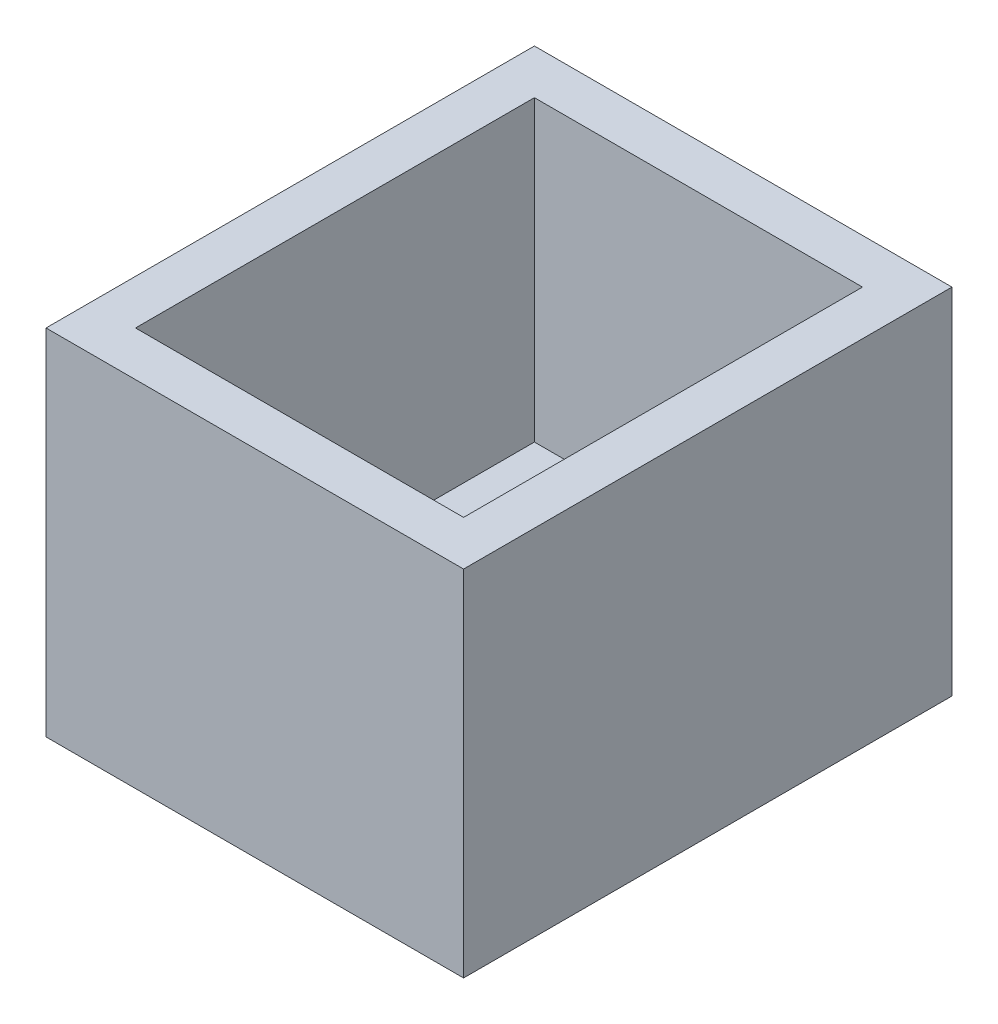
ISO-10303-21;
HEADER;
FILE_DESCRIPTION(('STEP AP214'),'2;1');
FILE_NAME('part.step','',(''),(''),'','','');
FILE_SCHEMA(('AUTOMOTIVE_DESIGN { 1 0 10303 214 1 1 1 1 }'));
ENDSEC;
DATA;
#1=APPLICATION_CONTEXT('core data for automotive mechanical design processes');
#2=APPLICATION_PROTOCOL_DEFINITION('international standard','automotive_design',2000,#1);
#3=PRODUCT_CONTEXT('',#1,'mechanical');
#4=PRODUCT('Part','Part','',(#3));
#5=PRODUCT_RELATED_PRODUCT_CATEGORY('part','',(#4));
#6=PRODUCT_DEFINITION_FORMATION('','',#4);
#7=PRODUCT_DEFINITION_CONTEXT('part definition',#1,'design');
#8=PRODUCT_DEFINITION('design','',#6,#7);
#9=PRODUCT_DEFINITION_SHAPE('','',#8);
#10=(LENGTH_UNIT() NAMED_UNIT(*) SI_UNIT(.MILLI.,.METRE.));
#11=(NAMED_UNIT(*) PLANE_ANGLE_UNIT() SI_UNIT($,.RADIAN.));
#12=(NAMED_UNIT(*) SI_UNIT($,.STERADIAN.) SOLID_ANGLE_UNIT());
#13=UNCERTAINTY_MEASURE_WITH_UNIT(LENGTH_MEASURE(1.E-05),#10,'distance_accuracy_value','');
#14=(GEOMETRIC_REPRESENTATION_CONTEXT(3) GLOBAL_UNCERTAINTY_ASSIGNED_CONTEXT((#13)) GLOBAL_UNIT_ASSIGNED_CONTEXT((#10,
#11,#12)) REPRESENTATION_CONTEXT('',''));
#15=CARTESIAN_POINT('',(0.,0.,0.));
#16=DIRECTION('',(0.,0.,1.));
#17=DIRECTION('',(1.,0.,0.));
#18=AXIS2_PLACEMENT_3D('',#15,#16,#17);
#19=CARTESIAN_POINT('',(0.,3.75,0.));
#20=DIRECTION('',(0.,1.,0.));
#21=DIRECTION('',(0.,0.,1.));
#22=AXIS2_PLACEMENT_3D('',#19,#20,#21);
#23=PLANE('',#22);
#24=DIRECTION('',(1.,0.,0.));
#25=VECTOR('',#24,1.);
#26=CARTESIAN_POINT('',(-55.4845587153636,3.75,25.2797790018917));
#27=LINE('',#26,#25);
#28=CARTESIAN_POINT('',(-50.9845587153636,3.75,25.2797790018917));
#29=VERTEX_POINT('',#28);
#30=CARTESIAN_POINT('',(-43.9845587153636,3.75,25.2797790018917));
#31=VERTEX_POINT('',#30);
#32=EDGE_CURVE('E363',#29,#31,#27,.T.);
#33=ORIENTED_EDGE('',*,*,#32,.F.);
#34=DIRECTION('',(0.,0.,-1.));
#35=VECTOR('',#34,1.);
#36=CARTESIAN_POINT('',(-50.9845587153636,3.75,25.2797790018917));
#37=LINE('',#36,#35);
#38=CARTESIAN_POINT('',(-50.9845587153636,3.75,24.0297790018917));
#39=VERTEX_POINT('',#38);
#40=EDGE_CURVE('E305',#29,#39,#37,.T.);
#41=ORIENTED_EDGE('',*,*,#40,.T.);
#42=DIRECTION('',(-1.,0.,0.));
#43=VECTOR('',#42,1.);
#44=CARTESIAN_POINT('',(-50.9845587153636,3.75,24.0297790018917));
#45=LINE('',#44,#43);
#46=CARTESIAN_POINT('',(-54.2345587153636,3.75,24.0297790018917));
#47=VERTEX_POINT('',#46);
#48=EDGE_CURVE('E339',#39,#47,#45,.T.);
#49=ORIENTED_EDGE('',*,*,#48,.T.);
#50=DIRECTION('',(0.,0.,-1.));
#51=VECTOR('',#50,1.);
#52=CARTESIAN_POINT('',(-54.2345587153636,3.75,24.0297790018917));
#53=LINE('',#52,#51);
#54=CARTESIAN_POINT('',(-54.2345587153636,3.75,5.77977900189171));
#55=VERTEX_POINT('',#54);
#56=EDGE_CURVE('E342',#47,#55,#53,.T.);
#57=ORIENTED_EDGE('',*,*,#56,.T.);
#58=DIRECTION('',(1.,0.,0.));
#59=VECTOR('',#58,1.);
#60=CARTESIAN_POINT('',(-54.2345587153636,3.75,5.77977900189171));
#61=LINE('',#60,#59);
#62=CARTESIAN_POINT('',(-50.9845587153636,3.75,5.77977900189171));
#63=VERTEX_POINT('',#62);
#64=EDGE_CURVE('E345',#55,#63,#61,.T.);
#65=ORIENTED_EDGE('',*,*,#64,.T.);
#66=DIRECTION('',(0.,0.,-1.));
#67=VECTOR('',#66,1.);
#68=CARTESIAN_POINT('',(-50.9845587153636,3.75,5.77977900189171));
#69=LINE('',#68,#67);
#70=CARTESIAN_POINT('',(-50.9845587153636,3.75,4.52977900189171));
#71=VERTEX_POINT('',#70);
#72=EDGE_CURVE('E318',#63,#71,#69,.T.);
#73=ORIENTED_EDGE('',*,*,#72,.T.);
#74=DIRECTION('',(-1.,0.,0.));
#75=VECTOR('',#74,1.);
#76=CARTESIAN_POINT('',(-55.4845587153636,3.75,4.52977900189171));
#77=LINE('',#76,#75);
#78=CARTESIAN_POINT('',(-43.9845587153636,3.75,4.52977900189171));
#79=VERTEX_POINT('',#78);
#80=EDGE_CURVE('E365',#79,#71,#77,.T.);
#81=ORIENTED_EDGE('',*,*,#80,.F.);
#82=DIRECTION('',(0.,0.,1.));
#83=VECTOR('',#82,1.);
#84=CARTESIAN_POINT('',(-43.9845587153636,3.75,5.77977900189171));
#85=LINE('',#84,#83);
#86=CARTESIAN_POINT('',(-43.9845587153636,3.75,5.77977900189171));
#87=VERTEX_POINT('',#86);
#88=EDGE_CURVE('E265',#79,#87,#85,.T.);
#89=ORIENTED_EDGE('',*,*,#88,.T.);
#90=DIRECTION('',(1.,0.,0.));
#91=VECTOR('',#90,1.);
#92=CARTESIAN_POINT('',(-43.9845587153636,3.75,5.77977900189171));
#93=LINE('',#92,#91);
#94=CARTESIAN_POINT('',(-40.7345587153636,3.75,5.77977900189171));
#95=VERTEX_POINT('',#94);
#96=EDGE_CURVE('E291',#87,#95,#93,.T.);
#97=ORIENTED_EDGE('',*,*,#96,.T.);
#98=DIRECTION('',(0.,0.,1.));
#99=VECTOR('',#98,1.);
#100=CARTESIAN_POINT('',(-40.7345587153636,3.75,5.77977900189171));
#101=LINE('',#100,#99);
#102=CARTESIAN_POINT('',(-40.7345587153636,3.75,24.0297790018917));
#103=VERTEX_POINT('',#102);
#104=EDGE_CURVE('E294',#95,#103,#101,.T.);
#105=ORIENTED_EDGE('',*,*,#104,.T.);
#106=DIRECTION('',(-1.,0.,0.));
#107=VECTOR('',#106,1.);
#108=CARTESIAN_POINT('',(-40.7345587153636,3.75,24.0297790018917));
#109=LINE('',#108,#107);
#110=CARTESIAN_POINT('',(-43.9845587153636,3.75,24.0297790018917));
#111=VERTEX_POINT('',#110);
#112=EDGE_CURVE('E297',#103,#111,#109,.T.);
#113=ORIENTED_EDGE('',*,*,#112,.T.);
#114=DIRECTION('',(0.,0.,1.));
#115=VECTOR('',#114,1.);
#116=CARTESIAN_POINT('',(-43.9845587153636,3.75,25.2797790018917));
#117=LINE('',#116,#115);
#118=EDGE_CURVE('E270',#111,#31,#117,.T.);
#119=ORIENTED_EDGE('',*,*,#118,.T.);
#120=EDGE_LOOP('',(#33,#41,#49,#57,#65,#73,#81,#89,#97,#105,#113,#119));
#121=FACE_BOUND('',#120,.T.);
#122=DIRECTION('',(1.,0.,0.));
#123=VECTOR('',#122,1.);
#124=CARTESIAN_POINT('',(-36.4845587153636,3.75,28.2797790018917));
#125=LINE('',#124,#123);
#126=CARTESIAN_POINT('',(-58.4845587153636,3.75,28.2797790018917));
#127=VERTEX_POINT('',#126);
#128=CARTESIAN_POINT('',(-36.4845587153636,3.75,28.2797790018917));
#129=VERTEX_POINT('',#128);
#130=EDGE_CURVE('E226',#127,#129,#125,.T.);
#131=ORIENTED_EDGE('',*,*,#130,.T.);
#132=DIRECTION('',(0.,0.,-1.));
#133=VECTOR('',#132,1.);
#134=CARTESIAN_POINT('',(-36.4845587153636,3.75,1.52977900189171));
#135=LINE('',#134,#133);
#136=CARTESIAN_POINT('',(-36.4845587153636,3.75,1.52977900189171));
#137=VERTEX_POINT('',#136);
#138=EDGE_CURVE('E48',#129,#137,#135,.T.);
#139=ORIENTED_EDGE('',*,*,#138,.T.);
#140=DIRECTION('',(-1.,0.,0.));
#141=VECTOR('',#140,1.);
#142=CARTESIAN_POINT('',(-36.4845587153636,3.75,1.52977900189171));
#143=LINE('',#142,#141);
#144=CARTESIAN_POINT('',(-58.4845587153636,3.75,1.52977900189171));
#145=VERTEX_POINT('',#144);
#146=EDGE_CURVE('E223',#137,#145,#143,.T.);
#147=ORIENTED_EDGE('',*,*,#146,.T.);
#148=DIRECTION('',(0.,0.,1.));
#149=VECTOR('',#148,1.);
#150=CARTESIAN_POINT('',(-58.4845587153636,3.75,1.52977900189171));
#151=LINE('',#150,#149);
#152=EDGE_CURVE('E210',#145,#127,#151,.T.);
#153=ORIENTED_EDGE('',*,*,#152,.T.);
#154=EDGE_LOOP('',(#131,#139,#147,#153));
#155=FACE_BOUND('',#154,.T.);
#156=ADVANCED_FACE('F33',(#121,#155),#23,.T.);
#157=CARTESIAN_POINT('',(-55.4845587153636,3.75,25.2797790018917));
#158=DIRECTION('',(1.,0.,0.));
#159=DIRECTION('',(0.,0.,-1.));
#160=AXIS2_PLACEMENT_3D('',#157,#158,#159);
#161=PLANE('',#160);
#162=DIRECTION('',(0.,-1.,0.));
#163=VECTOR('',#162,1.);
#164=CARTESIAN_POINT('',(-55.4845587153636,3.75,4.52977900189171));
#165=LINE('',#164,#163);
#166=CARTESIAN_POINT('',(-55.4845587153636,1.875,4.52977900189171));
#167=VERTEX_POINT('',#166);
#168=CARTESIAN_POINT('',(-55.4845587153636,0.,4.52977900189171));
#169=VERTEX_POINT('',#168);
#170=EDGE_CURVE('E368',#167,#169,#165,.T.);
#171=ORIENTED_EDGE('',*,*,#170,.F.);
#172=DIRECTION('',(0.,0.,1.));
#173=VECTOR('',#172,1.);
#174=CARTESIAN_POINT('',(-55.4845587153636,1.875,25.2797790018917));
#175=LINE('',#174,#173);
#176=CARTESIAN_POINT('',(-55.4845587153636,1.875,25.2797790018917));
#177=VERTEX_POINT('',#176);
#178=EDGE_CURVE('E332',#167,#177,#175,.T.);
#179=ORIENTED_EDGE('',*,*,#178,.T.);
#180=DIRECTION('',(0.,-1.,0.));
#181=VECTOR('',#180,1.);
#182=CARTESIAN_POINT('',(-55.4845587153636,3.75,25.2797790018917));
#183=LINE('',#182,#181);
#184=CARTESIAN_POINT('',(-55.4845587153636,0.,25.2797790018917));
#185=VERTEX_POINT('',#184);
#186=EDGE_CURVE('E11',#177,#185,#183,.T.);
#187=ORIENTED_EDGE('',*,*,#186,.T.);
#188=DIRECTION('',(0.,0.,1.));
#189=VECTOR('',#188,1.);
#190=CARTESIAN_POINT('',(-55.4845587153636,0.,25.2797790018917));
#191=LINE('',#190,#189);
#192=EDGE_CURVE('E352',#169,#185,#191,.T.);
#193=ORIENTED_EDGE('',*,*,#192,.F.);
#194=EDGE_LOOP('',(#171,#179,#187,#193));
#195=FACE_BOUND('',#194,.T.);
#196=ADVANCED_FACE('F395',(#195),#161,.T.);
#197=CARTESIAN_POINT('',(0.,0.,0.));
#198=DIRECTION('',(0.,1.,0.));
#199=DIRECTION('',(0.,0.,1.));
#200=AXIS2_PLACEMENT_3D('',#197,#198,#199);
#201=PLANE('',#200);
#202=DIRECTION('',(-1.,0.,0.));
#203=VECTOR('',#202,1.);
#204=CARTESIAN_POINT('',(-58.4845587153636,0.,-1.47022099810829));
#205=LINE('',#204,#203);
#206=CARTESIAN_POINT('',(-33.4845587153636,0.,-1.47022099810829));
#207=VERTEX_POINT('',#206);
#208=CARTESIAN_POINT('',(-61.4845587153636,0.,-1.47022099810829));
#209=VERTEX_POINT('',#208);
#210=EDGE_CURVE('E263',#207,#209,#205,.T.);
#211=ORIENTED_EDGE('',*,*,#210,.F.);
#212=DIRECTION('',(0.,0.,-1.));
#213=VECTOR('',#212,1.);
#214=CARTESIAN_POINT('',(-33.4845587153636,0.,-1.47022099810829));
#215=LINE('',#214,#213);
#216=CARTESIAN_POINT('',(-33.4845587153636,0.,31.2797790018917));
#217=VERTEX_POINT('',#216);
#218=EDGE_CURVE('E250',#217,#207,#215,.T.);
#219=ORIENTED_EDGE('',*,*,#218,.F.);
#220=DIRECTION('',(1.,0.,0.));
#221=VECTOR('',#220,1.);
#222=CARTESIAN_POINT('',(-36.4845587153636,0.,31.2797790018917));
#223=LINE('',#222,#221);
#224=CARTESIAN_POINT('',(-61.4845587153636,0.,31.2797790018917));
#225=VERTEX_POINT('',#224);
#226=EDGE_CURVE('E256',#225,#217,#223,.T.);
#227=ORIENTED_EDGE('',*,*,#226,.F.);
#228=DIRECTION('',(0.,0.,1.));
#229=VECTOR('',#228,1.);
#230=CARTESIAN_POINT('',(-61.4845587153636,0.,28.2797790018917));
#231=LINE('',#230,#229);
#232=EDGE_CURVE('E261',#209,#225,#231,.T.);
#233=ORIENTED_EDGE('',*,*,#232,.F.);
#234=EDGE_LOOP('',(#211,#219,#227,#233));
#235=FACE_BOUND('',#234,.T.);
#236=ORIENTED_EDGE('',*,*,#192,.T.);
#237=DIRECTION('',(1.,0.,0.));
#238=VECTOR('',#237,1.);
#239=CARTESIAN_POINT('',(-55.4845587153636,0.,25.2797790018917));
#240=LINE('',#239,#238);
#241=CARTESIAN_POINT('',(-39.4845587153636,0.,25.2797790018917));
#242=VERTEX_POINT('',#241);
#243=EDGE_CURVE('E371',#185,#242,#240,.T.);
#244=ORIENTED_EDGE('',*,*,#243,.T.);
#245=DIRECTION('',(0.,0.,-1.));
#246=VECTOR('',#245,1.);
#247=CARTESIAN_POINT('',(-39.4845587153636,0.,25.2797790018917));
#248=LINE('',#247,#246);
#249=CARTESIAN_POINT('',(-39.4845587153636,0.,4.52977900189171));
#250=VERTEX_POINT('',#249);
#251=EDGE_CURVE('E374',#242,#250,#248,.T.);
#252=ORIENTED_EDGE('',*,*,#251,.T.);
#253=DIRECTION('',(-1.,0.,0.));
#254=VECTOR('',#253,1.);
#255=CARTESIAN_POINT('',(-55.4845587153636,0.,4.52977900189171));
#256=LINE('',#255,#254);
#257=EDGE_CURVE('E366',#250,#169,#256,.T.);
#258=ORIENTED_EDGE('',*,*,#257,.T.);
#259=EDGE_LOOP('',(#236,#244,#252,#258));
#260=FACE_BOUND('',#259,.T.);
#261=ADVANCED_FACE('F35',(#235,#260),#201,.F.);
#262=CARTESIAN_POINT('',(-55.4845587153636,3.75,25.2797790018917));
#263=DIRECTION('',(0.,0.,-1.));
#264=DIRECTION('',(-1.,0.,0.));
#265=AXIS2_PLACEMENT_3D('',#262,#263,#264);
#266=PLANE('',#265);
#267=DIRECTION('',(0.,1.,0.));
#268=VECTOR('',#267,1.);
#269=CARTESIAN_POINT('',(-43.9845587153636,1.875,25.2797790018917));
#270=LINE('',#269,#268);
#271=CARTESIAN_POINT('',(-43.9845587153636,1.875,25.2797790018917));
#272=VERTEX_POINT('',#271);
#273=EDGE_CURVE('E56',#272,#31,#270,.T.);
#274=ORIENTED_EDGE('',*,*,#273,.F.);
#275=DIRECTION('',(1.,0.,0.));
#276=VECTOR('',#275,1.);
#277=CARTESIAN_POINT('',(-39.4845587153636,1.875,25.2797790018917));
#278=LINE('',#277,#276);
#279=CARTESIAN_POINT('',(-39.4845587153636,1.875,25.2797790018917));
#280=VERTEX_POINT('',#279);
#281=EDGE_CURVE('E282',#272,#280,#278,.T.);
#282=ORIENTED_EDGE('',*,*,#281,.T.);
#283=DIRECTION('',(0.,-1.,0.));
#284=VECTOR('',#283,1.);
#285=CARTESIAN_POINT('',(-39.4845587153636,3.75,25.2797790018917));
#286=LINE('',#285,#284);
#287=EDGE_CURVE('E41',#280,#242,#286,.T.);
#288=ORIENTED_EDGE('',*,*,#287,.T.);
#289=ORIENTED_EDGE('',*,*,#243,.F.);
#290=ORIENTED_EDGE('',*,*,#186,.F.);
#291=DIRECTION('',(1.,0.,0.));
#292=VECTOR('',#291,1.);
#293=CARTESIAN_POINT('',(-50.9845587153636,1.875,25.2797790018917));
#294=LINE('',#293,#292);
#295=CARTESIAN_POINT('',(-50.9845587153636,1.875,25.2797790018917));
#296=VERTEX_POINT('',#295);
#297=EDGE_CURVE('E334',#177,#296,#294,.T.);
#298=ORIENTED_EDGE('',*,*,#297,.T.);
#299=DIRECTION('',(0.,1.,0.));
#300=VECTOR('',#299,1.);
#301=CARTESIAN_POINT('',(-50.9845587153636,1.875,25.2797790018917));
#302=LINE('',#301,#300);
#303=EDGE_CURVE('E350',#296,#29,#302,.T.);
#304=ORIENTED_EDGE('',*,*,#303,.T.);
#305=ORIENTED_EDGE('',*,*,#32,.T.);
#306=EDGE_LOOP('',(#274,#282,#288,#289,#290,#298,#304,#305));
#307=FACE_BOUND('',#306,.T.);
#308=ADVANCED_FACE('F384',(#307),#266,.T.);
#309=CARTESIAN_POINT('',(-39.4845587153636,3.75,25.2797790018917));
#310=DIRECTION('',(-1.,0.,0.));
#311=DIRECTION('',(0.,0.,1.));
#312=AXIS2_PLACEMENT_3D('',#309,#310,#311);
#313=PLANE('',#312);
#314=DIRECTION('',(0.,0.,-1.));
#315=VECTOR('',#314,1.);
#316=CARTESIAN_POINT('',(-39.4845587153636,1.875,4.52977900189171));
#317=LINE('',#316,#315);
#318=CARTESIAN_POINT('',(-39.4845587153636,1.875,4.52977900189171));
#319=VERTEX_POINT('',#318);
#320=EDGE_CURVE('E284',#280,#319,#317,.T.);
#321=ORIENTED_EDGE('',*,*,#320,.T.);
#322=DIRECTION('',(0.,-1.,0.));
#323=VECTOR('',#322,1.);
#324=CARTESIAN_POINT('',(-39.4845587153636,3.75,4.52977900189171));
#325=LINE('',#324,#323);
#326=EDGE_CURVE('E380',#319,#250,#325,.T.);
#327=ORIENTED_EDGE('',*,*,#326,.T.);
#328=ORIENTED_EDGE('',*,*,#251,.F.);
#329=ORIENTED_EDGE('',*,*,#287,.F.);
#330=EDGE_LOOP('',(#321,#327,#328,#329));
#331=FACE_BOUND('',#330,.T.);
#332=ADVANCED_FACE('F388',(#331),#313,.T.);
#333=CARTESIAN_POINT('',(-55.4845587153636,3.75,4.52977900189171));
#334=DIRECTION('',(0.,0.,1.));
#335=DIRECTION('',(1.,0.,0.));
#336=AXIS2_PLACEMENT_3D('',#333,#334,#335);
#337=PLANE('',#336);
#338=DIRECTION('',(0.,1.,0.));
#339=VECTOR('',#338,1.);
#340=CARTESIAN_POINT('',(-43.9845587153636,1.875,4.52977900189171));
#341=LINE('',#340,#339);
#342=CARTESIAN_POINT('',(-43.9845587153636,1.875,4.52977900189171));
#343=VERTEX_POINT('',#342);
#344=EDGE_CURVE('E302',#343,#79,#341,.T.);
#345=ORIENTED_EDGE('',*,*,#344,.T.);
#346=ORIENTED_EDGE('',*,*,#80,.T.);
#347=DIRECTION('',(0.,1.,0.));
#348=VECTOR('',#347,1.);
#349=CARTESIAN_POINT('',(-50.9845587153636,1.875,4.52977900189171));
#350=LINE('',#349,#348);
#351=CARTESIAN_POINT('',(-50.9845587153636,1.875,4.52977900189171));
#352=VERTEX_POINT('',#351);
#353=EDGE_CURVE('E353',#352,#71,#350,.T.);
#354=ORIENTED_EDGE('',*,*,#353,.F.);
#355=DIRECTION('',(-1.,0.,0.));
#356=VECTOR('',#355,1.);
#357=CARTESIAN_POINT('',(-55.4845587153636,1.875,4.52977900189171));
#358=LINE('',#357,#356);
#359=EDGE_CURVE('E330',#352,#167,#358,.T.);
#360=ORIENTED_EDGE('',*,*,#359,.T.);
#361=ORIENTED_EDGE('',*,*,#170,.T.);
#362=ORIENTED_EDGE('',*,*,#257,.F.);
#363=ORIENTED_EDGE('',*,*,#326,.F.);
#364=DIRECTION('',(-1.,0.,0.));
#365=VECTOR('',#364,1.);
#366=CARTESIAN_POINT('',(-43.9845587153636,1.875,4.52977900189171));
#367=LINE('',#366,#365);
#368=EDGE_CURVE('E286',#319,#343,#367,.T.);
#369=ORIENTED_EDGE('',*,*,#368,.T.);
#370=EDGE_LOOP('',(#345,#346,#354,#360,#361,#362,#363,#369));
#371=FACE_BOUND('',#370,.T.);
#372=ADVANCED_FACE('F437',(#371),#337,.T.);
#373=CARTESIAN_POINT('',(-50.9845587153636,1.875,25.2797790018917));
#374=DIRECTION('',(1.,0.,0.));
#375=DIRECTION('',(0.,0.,-1.));
#376=AXIS2_PLACEMENT_3D('',#373,#374,#375);
#377=PLANE('',#376);
#378=ORIENTED_EDGE('',*,*,#40,.F.);
#379=ORIENTED_EDGE('',*,*,#303,.F.);
#380=DIRECTION('',(0.,0.,-1.));
#381=VECTOR('',#380,1.);
#382=CARTESIAN_POINT('',(-50.9845587153636,1.875,25.2797790018917));
#383=LINE('',#382,#381);
#384=CARTESIAN_POINT('',(-50.9845587153636,1.875,24.0297790018917));
#385=VERTEX_POINT('',#384);
#386=EDGE_CURVE('E314',#296,#385,#383,.T.);
#387=ORIENTED_EDGE('',*,*,#386,.T.);
#388=DIRECTION('',(0.,1.,0.));
#389=VECTOR('',#388,1.);
#390=CARTESIAN_POINT('',(-50.9845587153636,1.875,24.0297790018917));
#391=LINE('',#390,#389);
#392=EDGE_CURVE('E336',#385,#39,#391,.T.);
#393=ORIENTED_EDGE('',*,*,#392,.T.);
#394=EDGE_LOOP('',(#378,#379,#387,#393));
#395=FACE_BOUND('',#394,.T.);
#396=ADVANCED_FACE('F407',(#395),#377,.T.);
#397=CARTESIAN_POINT('',(-50.9845587153636,1.875,5.77977900189171));
#398=DIRECTION('',(1.,0.,0.));
#399=DIRECTION('',(0.,0.,-1.));
#400=AXIS2_PLACEMENT_3D('',#397,#398,#399);
#401=PLANE('',#400);
#402=ORIENTED_EDGE('',*,*,#72,.F.);
#403=DIRECTION('',(0.,1.,0.));
#404=VECTOR('',#403,1.);
#405=CARTESIAN_POINT('',(-50.9845587153636,1.875,5.77977900189171));
#406=LINE('',#405,#404);
#407=CARTESIAN_POINT('',(-50.9845587153636,1.875,5.77977900189171));
#408=VERTEX_POINT('',#407);
#409=EDGE_CURVE('E356',#408,#63,#406,.T.);
#410=ORIENTED_EDGE('',*,*,#409,.F.);
#411=DIRECTION('',(0.,0.,-1.));
#412=VECTOR('',#411,1.);
#413=CARTESIAN_POINT('',(-50.9845587153636,1.875,5.77977900189171));
#414=LINE('',#413,#412);
#415=EDGE_CURVE('E327',#408,#352,#414,.T.);
#416=ORIENTED_EDGE('',*,*,#415,.T.);
#417=ORIENTED_EDGE('',*,*,#353,.T.);
#418=EDGE_LOOP('',(#402,#410,#416,#417));
#419=FACE_BOUND('',#418,.T.);
#420=ADVANCED_FACE('F442',(#419),#401,.T.);
#421=CARTESIAN_POINT('',(-54.2345587153636,1.875,5.77977900189171));
#422=DIRECTION('',(0.,0.,1.));
#423=DIRECTION('',(1.,0.,0.));
#424=AXIS2_PLACEMENT_3D('',#421,#422,#423);
#425=PLANE('',#424);
#426=ORIENTED_EDGE('',*,*,#64,.F.);
#427=DIRECTION('',(0.,1.,0.));
#428=VECTOR('',#427,1.);
#429=CARTESIAN_POINT('',(-54.2345587153636,1.875,5.77977900189171));
#430=LINE('',#429,#428);
#431=CARTESIAN_POINT('',(-54.2345587153636,1.875,5.77977900189171));
#432=VERTEX_POINT('',#431);
#433=EDGE_CURVE('E358',#432,#55,#430,.T.);
#434=ORIENTED_EDGE('',*,*,#433,.F.);
#435=DIRECTION('',(1.,0.,0.));
#436=VECTOR('',#435,1.);
#437=CARTESIAN_POINT('',(-54.2345587153636,1.875,5.77977900189171));
#438=LINE('',#437,#436);
#439=EDGE_CURVE('E324',#432,#408,#438,.T.);
#440=ORIENTED_EDGE('',*,*,#439,.T.);
#441=ORIENTED_EDGE('',*,*,#409,.T.);
#442=EDGE_LOOP('',(#426,#434,#440,#441));
#443=FACE_BOUND('',#442,.T.);
#444=ADVANCED_FACE('F445',(#443),#425,.T.);
#445=CARTESIAN_POINT('',(-54.2345587153636,1.875,24.0297790018917));
#446=DIRECTION('',(1.,0.,0.));
#447=DIRECTION('',(0.,0.,-1.));
#448=AXIS2_PLACEMENT_3D('',#445,#446,#447);
#449=PLANE('',#448);
#450=ORIENTED_EDGE('',*,*,#56,.F.);
#451=DIRECTION('',(0.,1.,0.));
#452=VECTOR('',#451,1.);
#453=CARTESIAN_POINT('',(-54.2345587153636,1.875,24.0297790018917));
#454=LINE('',#453,#452);
#455=CARTESIAN_POINT('',(-54.2345587153636,1.875,24.0297790018917));
#456=VERTEX_POINT('',#455);
#457=EDGE_CURVE('E360',#456,#47,#454,.T.);
#458=ORIENTED_EDGE('',*,*,#457,.F.);
#459=DIRECTION('',(0.,0.,-1.));
#460=VECTOR('',#459,1.);
#461=CARTESIAN_POINT('',(-54.2345587153636,1.875,24.0297790018917));
#462=LINE('',#461,#460);
#463=EDGE_CURVE('E321',#456,#432,#462,.T.);
#464=ORIENTED_EDGE('',*,*,#463,.T.);
#465=ORIENTED_EDGE('',*,*,#433,.T.);
#466=EDGE_LOOP('',(#450,#458,#464,#465));
#467=FACE_BOUND('',#466,.T.);
#468=ADVANCED_FACE('F448',(#467),#449,.T.);
#469=CARTESIAN_POINT('',(-50.9845587153636,1.875,24.0297790018917));
#470=DIRECTION('',(0.,0.,-1.));
#471=DIRECTION('',(-1.,0.,0.));
#472=AXIS2_PLACEMENT_3D('',#469,#470,#471);
#473=PLANE('',#472);
#474=ORIENTED_EDGE('',*,*,#48,.F.);
#475=ORIENTED_EDGE('',*,*,#392,.F.);
#476=DIRECTION('',(-1.,0.,0.));
#477=VECTOR('',#476,1.);
#478=CARTESIAN_POINT('',(-50.9845587153636,1.875,24.0297790018917));
#479=LINE('',#478,#477);
#480=EDGE_CURVE('E317',#385,#456,#479,.T.);
#481=ORIENTED_EDGE('',*,*,#480,.T.);
#482=ORIENTED_EDGE('',*,*,#457,.T.);
#483=EDGE_LOOP('',(#474,#475,#481,#482));
#484=FACE_BOUND('',#483,.T.);
#485=ADVANCED_FACE('F450',(#484),#473,.T.);
#486=CARTESIAN_POINT('',(0.,1.875,0.));
#487=DIRECTION('',(0.,1.,0.));
#488=DIRECTION('',(0.,0.,1.));
#489=AXIS2_PLACEMENT_3D('',#486,#487,#488);
#490=PLANE('',#489);
#491=ORIENTED_EDGE('',*,*,#386,.F.);
#492=ORIENTED_EDGE('',*,*,#297,.F.);
#493=ORIENTED_EDGE('',*,*,#178,.F.);
#494=ORIENTED_EDGE('',*,*,#359,.F.);
#495=ORIENTED_EDGE('',*,*,#415,.F.);
#496=ORIENTED_EDGE('',*,*,#439,.F.);
#497=ORIENTED_EDGE('',*,*,#463,.F.);
#498=ORIENTED_EDGE('',*,*,#480,.F.);
#499=EDGE_LOOP('',(#491,#492,#493,#494,#495,#496,#497,#498));
#500=FACE_BOUND('',#499,.T.);
#501=ADVANCED_FACE('F401',(#500),#490,.F.);
#502=CARTESIAN_POINT('',(-43.9845587153636,1.875,5.77977900189171));
#503=DIRECTION('',(-1.,0.,0.));
#504=DIRECTION('',(0.,0.,1.));
#505=AXIS2_PLACEMENT_3D('',#502,#503,#504);
#506=PLANE('',#505);
#507=ORIENTED_EDGE('',*,*,#88,.F.);
#508=ORIENTED_EDGE('',*,*,#344,.F.);
#509=DIRECTION('',(0.,0.,1.));
#510=VECTOR('',#509,1.);
#511=CARTESIAN_POINT('',(-43.9845587153636,1.875,5.77977900189171));
#512=LINE('',#511,#510);
#513=CARTESIAN_POINT('',(-43.9845587153636,1.875,5.77977900189171));
#514=VERTEX_POINT('',#513);
#515=EDGE_CURVE('E266',#343,#514,#512,.T.);
#516=ORIENTED_EDGE('',*,*,#515,.T.);
#517=DIRECTION('',(0.,1.,0.));
#518=VECTOR('',#517,1.);
#519=CARTESIAN_POINT('',(-43.9845587153636,1.875,5.77977900189171));
#520=LINE('',#519,#518);
#521=EDGE_CURVE('E288',#514,#87,#520,.T.);
#522=ORIENTED_EDGE('',*,*,#521,.T.);
#523=EDGE_LOOP('',(#507,#508,#516,#522));
#524=FACE_BOUND('',#523,.T.);
#525=ADVANCED_FACE('F433',(#524),#506,.T.);
#526=CARTESIAN_POINT('',(-43.9845587153636,1.875,25.2797790018917));
#527=DIRECTION('',(-1.,0.,0.));
#528=DIRECTION('',(0.,0.,1.));
#529=AXIS2_PLACEMENT_3D('',#526,#527,#528);
#530=PLANE('',#529);
#531=ORIENTED_EDGE('',*,*,#118,.F.);
#532=DIRECTION('',(0.,1.,0.));
#533=VECTOR('',#532,1.);
#534=CARTESIAN_POINT('',(-43.9845587153636,1.875,24.0297790018917));
#535=LINE('',#534,#533);
#536=CARTESIAN_POINT('',(-43.9845587153636,1.875,24.0297790018917));
#537=VERTEX_POINT('',#536);
#538=EDGE_CURVE('E307',#537,#111,#535,.T.);
#539=ORIENTED_EDGE('',*,*,#538,.F.);
#540=DIRECTION('',(0.,0.,1.));
#541=VECTOR('',#540,1.);
#542=CARTESIAN_POINT('',(-43.9845587153636,1.875,25.2797790018917));
#543=LINE('',#542,#541);
#544=EDGE_CURVE('E279',#537,#272,#543,.T.);
#545=ORIENTED_EDGE('',*,*,#544,.T.);
#546=ORIENTED_EDGE('',*,*,#273,.T.);
#547=EDGE_LOOP('',(#531,#539,#545,#546));
#548=FACE_BOUND('',#547,.T.);
#549=ADVANCED_FACE('F415',(#548),#530,.T.);
#550=CARTESIAN_POINT('',(-40.7345587153636,1.875,24.0297790018917));
#551=DIRECTION('',(0.,0.,-1.));
#552=DIRECTION('',(-1.,0.,0.));
#553=AXIS2_PLACEMENT_3D('',#550,#551,#552);
#554=PLANE('',#553);
#555=ORIENTED_EDGE('',*,*,#112,.F.);
#556=DIRECTION('',(0.,1.,0.));
#557=VECTOR('',#556,1.);
#558=CARTESIAN_POINT('',(-40.7345587153636,1.875,24.0297790018917));
#559=LINE('',#558,#557);
#560=CARTESIAN_POINT('',(-40.7345587153636,1.875,24.0297790018917));
#561=VERTEX_POINT('',#560);
#562=EDGE_CURVE('E309',#561,#103,#559,.T.);
#563=ORIENTED_EDGE('',*,*,#562,.F.);
#564=DIRECTION('',(-1.,0.,0.));
#565=VECTOR('',#564,1.);
#566=CARTESIAN_POINT('',(-40.7345587153636,1.875,24.0297790018917));
#567=LINE('',#566,#565);
#568=EDGE_CURVE('E276',#561,#537,#567,.T.);
#569=ORIENTED_EDGE('',*,*,#568,.T.);
#570=ORIENTED_EDGE('',*,*,#538,.T.);
#571=EDGE_LOOP('',(#555,#563,#569,#570));
#572=FACE_BOUND('',#571,.T.);
#573=ADVANCED_FACE('F423',(#572),#554,.T.);
#574=CARTESIAN_POINT('',(-40.7345587153636,1.875,5.77977900189171));
#575=DIRECTION('',(-1.,0.,0.));
#576=DIRECTION('',(0.,0.,1.));
#577=AXIS2_PLACEMENT_3D('',#574,#575,#576);
#578=PLANE('',#577);
#579=ORIENTED_EDGE('',*,*,#104,.F.);
#580=DIRECTION('',(0.,1.,0.));
#581=VECTOR('',#580,1.);
#582=CARTESIAN_POINT('',(-40.7345587153636,1.875,5.77977900189171));
#583=LINE('',#582,#581);
#584=CARTESIAN_POINT('',(-40.7345587153636,1.875,5.77977900189171));
#585=VERTEX_POINT('',#584);
#586=EDGE_CURVE('E311',#585,#95,#583,.T.);
#587=ORIENTED_EDGE('',*,*,#586,.F.);
#588=DIRECTION('',(0.,0.,1.));
#589=VECTOR('',#588,1.);
#590=CARTESIAN_POINT('',(-40.7345587153636,1.875,5.77977900189171));
#591=LINE('',#590,#589);
#592=EDGE_CURVE('E273',#585,#561,#591,.T.);
#593=ORIENTED_EDGE('',*,*,#592,.T.);
#594=ORIENTED_EDGE('',*,*,#562,.T.);
#595=EDGE_LOOP('',(#579,#587,#593,#594));
#596=FACE_BOUND('',#595,.T.);
#597=ADVANCED_FACE('F426',(#596),#578,.T.);
#598=CARTESIAN_POINT('',(-43.9845587153636,1.875,5.77977900189171));
#599=DIRECTION('',(0.,0.,1.));
#600=DIRECTION('',(1.,0.,0.));
#601=AXIS2_PLACEMENT_3D('',#598,#599,#600);
#602=PLANE('',#601);
#603=ORIENTED_EDGE('',*,*,#96,.F.);
#604=ORIENTED_EDGE('',*,*,#521,.F.);
#605=DIRECTION('',(1.,0.,0.));
#606=VECTOR('',#605,1.);
#607=CARTESIAN_POINT('',(-43.9845587153636,1.875,5.77977900189171));
#608=LINE('',#607,#606);
#609=EDGE_CURVE('E269',#514,#585,#608,.T.);
#610=ORIENTED_EDGE('',*,*,#609,.T.);
#611=ORIENTED_EDGE('',*,*,#586,.T.);
#612=EDGE_LOOP('',(#603,#604,#610,#611));
#613=FACE_BOUND('',#612,.T.);
#614=ADVANCED_FACE('F430',(#613),#602,.T.);
#615=CARTESIAN_POINT('',(0.,1.875,0.));
#616=DIRECTION('',(0.,-1.,0.));
#617=DIRECTION('',(0.,0.,-1.));
#618=AXIS2_PLACEMENT_3D('',#615,#616,#617);
#619=PLANE('',#618);
#620=ORIENTED_EDGE('',*,*,#515,.F.);
#621=ORIENTED_EDGE('',*,*,#368,.F.);
#622=ORIENTED_EDGE('',*,*,#320,.F.);
#623=ORIENTED_EDGE('',*,*,#281,.F.);
#624=ORIENTED_EDGE('',*,*,#544,.F.);
#625=ORIENTED_EDGE('',*,*,#568,.F.);
#626=ORIENTED_EDGE('',*,*,#592,.F.);
#627=ORIENTED_EDGE('',*,*,#609,.F.);
#628=EDGE_LOOP('',(#620,#621,#622,#623,#624,#625,#626,#627));
#629=FACE_BOUND('',#628,.T.);
#630=ADVANCED_FACE('F420',(#629),#619,.T.);
#631=CARTESIAN_POINT('',(0.,0.,-1.47022099810829));
#632=DIRECTION('',(0.,0.,-1.));
#633=DIRECTION('',(-1.,0.,0.));
#634=AXIS2_PLACEMENT_3D('',#631,#632,#633);
#635=PLANE('',#634);
#636=ORIENTED_EDGE('',*,*,#210,.T.);
#637=DIRECTION('',(0.,-1.,0.));
#638=VECTOR('',#637,1.);
#639=CARTESIAN_POINT('',(-61.4845587153636,3.75,-1.47022099810829));
#640=LINE('',#639,#638);
#641=CARTESIAN_POINT('',(-61.4845587153636,23.75,-1.47022099810829));
#642=VERTEX_POINT('',#641);
#643=EDGE_CURVE('E258',#642,#209,#640,.T.);
#644=ORIENTED_EDGE('',*,*,#643,.F.);
#645=DIRECTION('',(-1.,0.,0.));
#646=VECTOR('',#645,1.);
#647=CARTESIAN_POINT('',(-33.4845587153636,23.75,-1.47022099810829));
#648=LINE('',#647,#646);
#649=CARTESIAN_POINT('',(-33.4845587153636,23.75,-1.47022099810829));
#650=VERTEX_POINT('',#649);
#651=EDGE_CURVE('E236',#650,#642,#648,.T.);
#652=ORIENTED_EDGE('',*,*,#651,.F.);
#653=DIRECTION('',(0.,1.,0.));
#654=VECTOR('',#653,1.);
#655=CARTESIAN_POINT('',(-33.4845587153636,3.75,-1.47022099810829));
#656=LINE('',#655,#654);
#657=EDGE_CURVE('E245',#207,#650,#656,.T.);
#658=ORIENTED_EDGE('',*,*,#657,.F.);
#659=EDGE_LOOP('',(#636,#644,#652,#658));
#660=FACE_BOUND('',#659,.T.);
#661=ADVANCED_FACE('F493',(#660),#635,.T.);
#662=CARTESIAN_POINT('',(-61.4845587153636,0.,0.));
#663=DIRECTION('',(1.,0.,0.));
#664=DIRECTION('',(0.,0.,-1.));
#665=AXIS2_PLACEMENT_3D('',#662,#663,#664);
#666=PLANE('',#665);
#667=ORIENTED_EDGE('',*,*,#232,.T.);
#668=DIRECTION('',(0.,-1.,0.));
#669=VECTOR('',#668,1.);
#670=CARTESIAN_POINT('',(-61.4845587153636,3.75,31.2797790018917));
#671=LINE('',#670,#669);
#672=CARTESIAN_POINT('',(-61.4845587153636,23.75,31.2797790018917));
#673=VERTEX_POINT('',#672);
#674=EDGE_CURVE('E253',#673,#225,#671,.T.);
#675=ORIENTED_EDGE('',*,*,#674,.F.);
#676=DIRECTION('',(0.,0.,1.));
#677=VECTOR('',#676,1.);
#678=CARTESIAN_POINT('',(-61.4845587153636,23.75,-1.47022099810829));
#679=LINE('',#678,#677);
#680=EDGE_CURVE('E239',#642,#673,#679,.T.);
#681=ORIENTED_EDGE('',*,*,#680,.F.);
#682=ORIENTED_EDGE('',*,*,#643,.T.);
#683=EDGE_LOOP('',(#667,#675,#681,#682));
#684=FACE_BOUND('',#683,.T.);
#685=ADVANCED_FACE('F496',(#684),#666,.F.);
#686=CARTESIAN_POINT('',(0.,0.,31.2797790018917));
#687=DIRECTION('',(0.,0.,-1.));
#688=DIRECTION('',(-1.,0.,0.));
#689=AXIS2_PLACEMENT_3D('',#686,#687,#688);
#690=PLANE('',#689);
#691=ORIENTED_EDGE('',*,*,#226,.T.);
#692=DIRECTION('',(0.,-1.,0.));
#693=VECTOR('',#692,1.);
#694=CARTESIAN_POINT('',(-33.4845587153636,3.75,31.2797790018917));
#695=LINE('',#694,#693);
#696=CARTESIAN_POINT('',(-33.4845587153636,23.75,31.2797790018917));
#697=VERTEX_POINT('',#696);
#698=EDGE_CURVE('E247',#697,#217,#695,.T.);
#699=ORIENTED_EDGE('',*,*,#698,.F.);
#700=DIRECTION('',(1.,0.,0.));
#701=VECTOR('',#700,1.);
#702=CARTESIAN_POINT('',(-33.4845587153636,23.75,31.2797790018917));
#703=LINE('',#702,#701);
#704=EDGE_CURVE('E242',#673,#697,#703,.T.);
#705=ORIENTED_EDGE('',*,*,#704,.F.);
#706=ORIENTED_EDGE('',*,*,#674,.T.);
#707=EDGE_LOOP('',(#691,#699,#705,#706));
#708=FACE_BOUND('',#707,.T.);
#709=ADVANCED_FACE('F500',(#708),#690,.F.);
#710=CARTESIAN_POINT('',(-33.4845587153636,0.,0.));
#711=DIRECTION('',(-1.,0.,0.));
#712=DIRECTION('',(0.,0.,1.));
#713=AXIS2_PLACEMENT_3D('',#710,#711,#712);
#714=PLANE('',#713);
#715=ORIENTED_EDGE('',*,*,#657,.T.);
#716=DIRECTION('',(0.,0.,-1.));
#717=VECTOR('',#716,1.);
#718=CARTESIAN_POINT('',(-33.4845587153636,23.75,-1.47022099810829));
#719=LINE('',#718,#717);
#720=EDGE_CURVE('E211',#697,#650,#719,.T.);
#721=ORIENTED_EDGE('',*,*,#720,.F.);
#722=ORIENTED_EDGE('',*,*,#698,.T.);
#723=ORIENTED_EDGE('',*,*,#218,.T.);
#724=EDGE_LOOP('',(#715,#721,#722,#723));
#725=FACE_BOUND('',#724,.T.);
#726=ADVANCED_FACE('F504',(#725),#714,.F.);
#727=CARTESIAN_POINT('',(0.,23.75,0.));
#728=DIRECTION('',(0.,-1.,0.));
#729=DIRECTION('',(0.,0.,-1.));
#730=AXIS2_PLACEMENT_3D('',#727,#728,#729);
#731=PLANE('',#730);
#732=ORIENTED_EDGE('',*,*,#720,.T.);
#733=ORIENTED_EDGE('',*,*,#651,.T.);
#734=ORIENTED_EDGE('',*,*,#680,.T.);
#735=ORIENTED_EDGE('',*,*,#704,.T.);
#736=EDGE_LOOP('',(#732,#733,#734,#735));
#737=FACE_BOUND('',#736,.T.);
#738=DIRECTION('',(-1.,0.,0.));
#739=VECTOR('',#738,1.);
#740=CARTESIAN_POINT('',(-36.4845587153636,23.75,1.52977900189171));
#741=LINE('',#740,#739);
#742=CARTESIAN_POINT('',(-36.4845587153636,23.75,1.52977900189171));
#743=VERTEX_POINT('',#742);
#744=CARTESIAN_POINT('',(-58.4845587153636,23.75,1.52977900189171));
#745=VERTEX_POINT('',#744);
#746=EDGE_CURVE('E195',#743,#745,#741,.T.);
#747=ORIENTED_EDGE('',*,*,#746,.F.);
#748=DIRECTION('',(0.,0.,-1.));
#749=VECTOR('',#748,1.);
#750=CARTESIAN_POINT('',(-36.4845587153636,23.75,1.52977900189171));
#751=LINE('',#750,#749);
#752=CARTESIAN_POINT('',(-36.4845587153636,23.75,28.2797790018917));
#753=VERTEX_POINT('',#752);
#754=EDGE_CURVE('E219',#753,#743,#751,.T.);
#755=ORIENTED_EDGE('',*,*,#754,.F.);
#756=DIRECTION('',(1.,0.,0.));
#757=VECTOR('',#756,1.);
#758=CARTESIAN_POINT('',(-36.4845587153636,23.75,28.2797790018917));
#759=LINE('',#758,#757);
#760=CARTESIAN_POINT('',(-58.4845587153636,23.75,28.2797790018917));
#761=VERTEX_POINT('',#760);
#762=EDGE_CURVE('E217',#761,#753,#759,.T.);
#763=ORIENTED_EDGE('',*,*,#762,.F.);
#764=DIRECTION('',(0.,0.,1.));
#765=VECTOR('',#764,1.);
#766=CARTESIAN_POINT('',(-58.4845587153636,23.75,1.52977900189171));
#767=LINE('',#766,#765);
#768=EDGE_CURVE('E204',#745,#761,#767,.T.);
#769=ORIENTED_EDGE('',*,*,#768,.F.);
#770=EDGE_LOOP('',(#747,#755,#763,#769));
#771=FACE_BOUND('',#770,.T.);
#772=ADVANCED_FACE('F215',(#737,#771),#731,.F.);
#773=CARTESIAN_POINT('',(-36.4845587153636,23.75,1.52977900189171));
#774=DIRECTION('',(0.,0.,1.));
#775=DIRECTION('',(1.,0.,0.));
#776=AXIS2_PLACEMENT_3D('',#773,#774,#775);
#777=PLANE('',#776);
#778=ORIENTED_EDGE('',*,*,#146,.F.);
#779=DIRECTION('',(0.,-1.,0.));
#780=VECTOR('',#779,1.);
#781=CARTESIAN_POINT('',(-36.4845587153636,23.75,1.52977900189171));
#782=LINE('',#781,#780);
#783=EDGE_CURVE('E200',#743,#137,#782,.T.);
#784=ORIENTED_EDGE('',*,*,#783,.F.);
#785=ORIENTED_EDGE('',*,*,#746,.T.);
#786=DIRECTION('',(0.,-1.,0.));
#787=VECTOR('',#786,1.);
#788=CARTESIAN_POINT('',(-58.4845587153636,23.75,1.52977900189171));
#789=LINE('',#788,#787);
#790=EDGE_CURVE('E198',#745,#145,#789,.T.);
#791=ORIENTED_EDGE('',*,*,#790,.T.);
#792=EDGE_LOOP('',(#778,#784,#785,#791));
#793=FACE_BOUND('',#792,.T.);
#794=ADVANCED_FACE('F197',(#793),#777,.T.);
#795=CARTESIAN_POINT('',(-58.4845587153636,23.75,1.52977900189171));
#796=DIRECTION('',(1.,0.,0.));
#797=DIRECTION('',(0.,0.,-1.));
#798=AXIS2_PLACEMENT_3D('',#795,#796,#797);
#799=PLANE('',#798);
#800=ORIENTED_EDGE('',*,*,#152,.F.);
#801=ORIENTED_EDGE('',*,*,#790,.F.);
#802=ORIENTED_EDGE('',*,*,#768,.T.);
#803=DIRECTION('',(0.,-1.,0.));
#804=VECTOR('',#803,1.);
#805=CARTESIAN_POINT('',(-58.4845587153636,23.75,28.2797790018917));
#806=LINE('',#805,#804);
#807=EDGE_CURVE('E212',#761,#127,#806,.T.);
#808=ORIENTED_EDGE('',*,*,#807,.T.);
#809=EDGE_LOOP('',(#800,#801,#802,#808));
#810=FACE_BOUND('',#809,.T.);
#811=ADVANCED_FACE('F207',(#810),#799,.T.);
#812=CARTESIAN_POINT('',(-36.4845587153636,23.75,28.2797790018917));
#813=DIRECTION('',(0.,0.,-1.));
#814=DIRECTION('',(-1.,0.,0.));
#815=AXIS2_PLACEMENT_3D('',#812,#813,#814);
#816=PLANE('',#815);
#817=ORIENTED_EDGE('',*,*,#130,.F.);
#818=ORIENTED_EDGE('',*,*,#807,.F.);
#819=ORIENTED_EDGE('',*,*,#762,.T.);
#820=DIRECTION('',(0.,-1.,0.));
#821=VECTOR('',#820,1.);
#822=CARTESIAN_POINT('',(-36.4845587153636,23.75,28.2797790018917));
#823=LINE('',#822,#821);
#824=EDGE_CURVE('E231',#753,#129,#823,.T.);
#825=ORIENTED_EDGE('',*,*,#824,.T.);
#826=EDGE_LOOP('',(#817,#818,#819,#825));
#827=FACE_BOUND('',#826,.T.);
#828=ADVANCED_FACE('F516',(#827),#816,.T.);
#829=CARTESIAN_POINT('',(-36.4845587153636,23.75,1.52977900189171));
#830=DIRECTION('',(-1.,0.,0.));
#831=DIRECTION('',(0.,0.,1.));
#832=AXIS2_PLACEMENT_3D('',#829,#830,#831);
#833=PLANE('',#832);
#834=ORIENTED_EDGE('',*,*,#138,.F.);
#835=ORIENTED_EDGE('',*,*,#824,.F.);
#836=ORIENTED_EDGE('',*,*,#754,.T.);
#837=ORIENTED_EDGE('',*,*,#783,.T.);
#838=EDGE_LOOP('',(#834,#835,#836,#837));
#839=FACE_BOUND('',#838,.T.);
#840=ADVANCED_FACE('F519',(#839),#833,.T.);
#841=CLOSED_SHELL('',(#156,#196,#261,#308,#332,#372,#396,#420,#444,#468,#485,#501,#525,#549,
#573,#597,#614,#630,#661,#685,#709,#726,#772,#794,#811,#828,#840));
#842=MANIFOLD_SOLID_BREP('B2',#841);
#843=ADVANCED_BREP_SHAPE_REPRESENTATION('',(#18,#842),#14);
#844=SHAPE_DEFINITION_REPRESENTATION(#9,#843);
ENDSEC;
END-ISO-10303-21;
